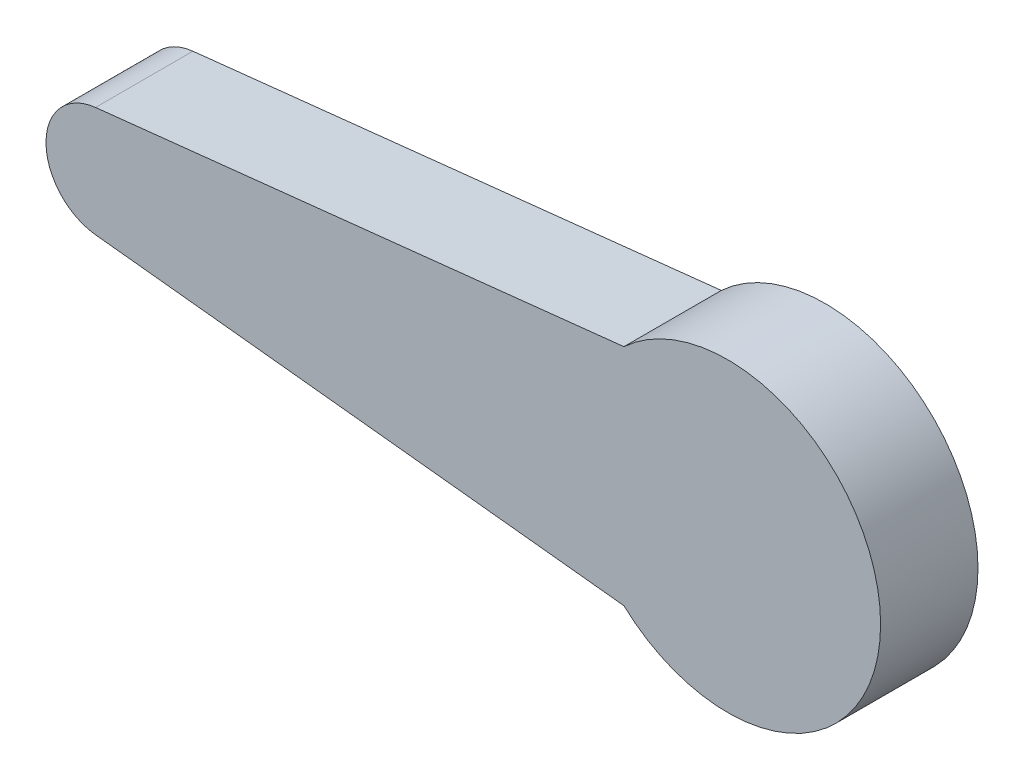
ISO-10303-21;
HEADER;
FILE_DESCRIPTION(('STEP AP214'),'2;1');
FILE_NAME('part.step','',(''),(''),'','','');
FILE_SCHEMA(('AUTOMOTIVE_DESIGN { 1 0 10303 214 1 1 1 1 }'));
ENDSEC;
DATA;
#1=APPLICATION_CONTEXT('core data for automotive mechanical design processes');
#2=APPLICATION_PROTOCOL_DEFINITION('international standard','automotive_design',2000,#1);
#3=PRODUCT_CONTEXT('',#1,'mechanical');
#4=PRODUCT('Part','Part','',(#3));
#5=PRODUCT_RELATED_PRODUCT_CATEGORY('part','',(#4));
#6=PRODUCT_DEFINITION_FORMATION('','',#4);
#7=PRODUCT_DEFINITION_CONTEXT('part definition',#1,'design');
#8=PRODUCT_DEFINITION('design','',#6,#7);
#9=PRODUCT_DEFINITION_SHAPE('','',#8);
#10=(LENGTH_UNIT() NAMED_UNIT(*) SI_UNIT(.MILLI.,.METRE.));
#11=(NAMED_UNIT(*) PLANE_ANGLE_UNIT() SI_UNIT($,.RADIAN.));
#12=(NAMED_UNIT(*) SI_UNIT($,.STERADIAN.) SOLID_ANGLE_UNIT());
#13=UNCERTAINTY_MEASURE_WITH_UNIT(LENGTH_MEASURE(1.E-05),#10,'distance_accuracy_value','');
#14=(GEOMETRIC_REPRESENTATION_CONTEXT(3) GLOBAL_UNCERTAINTY_ASSIGNED_CONTEXT((#13)) GLOBAL_UNIT_ASSIGNED_CONTEXT((#10,
#11,#12)) REPRESENTATION_CONTEXT('',''));
#15=CARTESIAN_POINT('',(0.,0.,0.));
#16=DIRECTION('',(0.,0.,1.));
#17=DIRECTION('',(1.,0.,0.));
#18=AXIS2_PLACEMENT_3D('',#15,#16,#17);
#19=CARTESIAN_POINT('',(-13.5203480100039,0.,0.));
#20=DIRECTION('',(0.,0.,1.));
#21=DIRECTION('',(1.,0.,0.));
#22=AXIS2_PLACEMENT_3D('',#19,#20,#21);
#23=PLANE('',#22);
#24=DIRECTION('',(-0.994225438983225,-0.10731158594771,0.));
#25=VECTOR('',#24,1.);
#26=CARTESIAN_POINT('',(7.93694518506527,4.60750982165337,0.));
#27=LINE('',#26,#25);
#28=CARTESIAN_POINT('',(7.93694518506527,4.60750982165337,0.));
#29=VERTEX_POINT('',#28);
#30=CARTESIAN_POINT('',(-13.7648346347147,2.26513120304724,0.));
#31=VERTEX_POINT('',#30);
#32=EDGE_CURVE('E133',#29,#31,#27,.T.);
#33=ORIENTED_EDGE('',*,*,#32,.F.);
#34=CARTESIAN_POINT('',(12.2013646778512,0.,0.));
#35=DIRECTION('',(0.,0.,-1.));
#36=DIRECTION('',(-1.,0.,0.));
#37=AXIS2_PLACEMENT_3D('',#34,#35,#36);
#38=CIRCLE('',#37,6.2780905032569);
#39=CARTESIAN_POINT('',(7.93694518506527,-4.60750982165337,0.));
#40=VERTEX_POINT('',#39);
#41=EDGE_CURVE('E144',#29,#40,#38,.T.);
#42=ORIENTED_EDGE('',*,*,#41,.T.);
#43=DIRECTION('',(0.994225438983225,-0.10731158594771,0.));
#44=VECTOR('',#43,1.);
#45=CARTESIAN_POINT('',(-13.7648346347147,-2.26513120304724,0.));
#46=LINE('',#45,#44);
#47=CARTESIAN_POINT('',(-13.7648346347147,-2.26513120304724,0.));
#48=VERTEX_POINT('',#47);
#49=EDGE_CURVE('E151',#48,#40,#46,.T.);
#50=ORIENTED_EDGE('',*,*,#49,.F.);
#51=CARTESIAN_POINT('',(-13.5203480100039,0.,0.));
#52=DIRECTION('',(0.,0.,1.));
#53=DIRECTION('',(1.,0.,0.));
#54=AXIS2_PLACEMENT_3D('',#51,#52,#53);
#55=CIRCLE('',#54,2.27828731214496);
#56=EDGE_CURVE('E136',#31,#48,#55,.T.);
#57=ORIENTED_EDGE('',*,*,#56,.F.);
#58=EDGE_LOOP('',(#33,#42,#50,#57));
#59=FACE_BOUND('',#58,.T.);
#60=CARTESIAN_POINT('',(-2.30825995095074,2.49806605279446,0.));
#61=CARTESIAN_POINT('',(-2.73027096534099,2.49868152297986,0.));
#62=CARTESIAN_POINT('',(-3.36525519111259,2.31776714159565,0.));
#63=CARTESIAN_POINT('',(-4.0519471173828,1.79121945249872,0.));
#64=CARTESIAN_POINT('',(-4.45450445000801,1.26652861552728,0.));
#65=CARTESIAN_POINT('',(-4.70755649296628,0.655614107295277,0.));
#66=CARTESIAN_POINT('',(-4.79387213088173,0.,0.));
#67=CARTESIAN_POINT('',(-4.70755649296628,-0.655614107295276,0.));
#68=CARTESIAN_POINT('',(-4.45450445000801,-1.26652861552729,0.));
#69=CARTESIAN_POINT('',(-4.0519471173828,-1.79121945249872,0.));
#70=CARTESIAN_POINT('',(-3.36525519111259,-2.31776714159565,0.));
#71=CARTESIAN_POINT('',(-2.73027096534099,-2.49868152297986,0.));
#72=CARTESIAN_POINT('',(-2.30825995095074,-2.49806605279446,0.));
#73=B_SPLINE_CURVE_WITH_KNOTS('',3,(#60,#61,#62,#63,#64,#65,#66,#67,#68,#69,#70,#71,#72),
.UNSPECIFIED.,.F.,.F.,(4,1,1,1,1,1,1,1,1,1,4),(0.,0.162547315698738,0.246910500112196,
0.331273484688599,0.415637005846892,0.5,0.584362994153108,0.668726515311401,0.753089499887804,
0.837452684301262,1.),.UNSPECIFIED.);
#74=CARTESIAN_POINT('',(-2.30825995095074,2.49806605279446,0.));
#75=VERTEX_POINT('',#74);
#76=CARTESIAN_POINT('',(-2.30825995095074,-2.49806605279446,0.));
#77=VERTEX_POINT('',#76);
#78=EDGE_CURVE('E55',#75,#77,#73,.T.);
#79=ORIENTED_EDGE('',*,*,#78,.T.);
#80=DIRECTION('',(0.998250566900798,-0.0591253387494285,0.));
#81=VECTOR('',#80,1.);
#82=CARTESIAN_POINT('',(9.37504414469004,-3.19005595520139,0.));
#83=LINE('',#82,#81);
#84=CARTESIAN_POINT('',(9.37504414469004,-3.19005595520139,0.));
#85=VERTEX_POINT('',#84);
#86=EDGE_CURVE('E132',#77,#85,#83,.T.);
#87=ORIENTED_EDGE('',*,*,#86,.T.);
#88=CARTESIAN_POINT('',(9.37504414469004,-3.19005595520139,0.));
#89=CARTESIAN_POINT('',(9.74360040876109,-3.53484293919703,0.));
#90=CARTESIAN_POINT('',(10.5428570191187,-3.88633535555283,0.));
#91=CARTESIAN_POINT('',(11.7382013204245,-4.05165126945385,0.));
#92=CARTESIAN_POINT('',(12.7877855246039,-3.91194774983133,0.));
#93=CARTESIAN_POINT('',(13.7642990955492,-3.50777948619926,0.));
#94=CARTESIAN_POINT('',(14.6032502640424,-2.86396771618949,0.));
#95=CARTESIAN_POINT('',(15.2468503589831,-2.02521728614815,0.));
#96=CARTESIAN_POINT('',(15.6516651084562,-1.04811231295659,0.));
#97=CARTESIAN_POINT('',(15.7889928154445,-0.000691817754812136,0.));
#98=CARTESIAN_POINT('',(15.6535287568039,1.05087958765089,0.));
#99=CARTESIAN_POINT('',(15.2393957517555,2.01553180953456,0.));
#100=CARTESIAN_POINT('',(14.749448402042,2.72799658708562,0.));
#101=CARTESIAN_POINT('',(14.1725249859326,3.12361030474993,0.));
#102=CARTESIAN_POINT('',(13.6476475877295,3.58835164958077,0.));
#103=CARTESIAN_POINT('',(12.7816062725977,3.90400354803467,0.));
#104=CARTESIAN_POINT('',(11.739855888239,4.05377842345117,0.));
#105=CARTESIAN_POINT('',(10.54211336446,3.88537929441961,0.));
#106=CARTESIAN_POINT('',(9.74376271711854,3.53505160690367,0.));
#107=CARTESIAN_POINT('',(9.37504414469004,3.19005595520139,0.));
#108=B_SPLINE_CURVE_WITH_KNOTS('',3,(#88,#89,#90,#91,#92,#93,#94,#95,#96,#97,#98,#99,#100,#101,
#102,#103,#104,#105,#106,#107),.UNSPECIFIED.,.F.,.F.,(4,1,1,1,1,1,1,1,1,1,1,1,1,1,1,1,1,4),(0.,
0.0851368769983083,0.144403022869954,0.2036691687416,0.262935433986645,0.32220149870547,
0.381467600441595,0.440733878928586,0.499999999999802,0.559266121071018,0.618532399558009,
0.677798501294134,0.702497282971547,0.737064566013355,0.7963308312584,0.855596977130046,
0.914863123001692,1.),.UNSPECIFIED.);
#109=CARTESIAN_POINT('',(9.37504414469004,3.19005595520139,0.));
#110=VERTEX_POINT('',#109);
#111=EDGE_CURVE('E304',#85,#110,#108,.T.);
#112=ORIENTED_EDGE('',*,*,#111,.T.);
#113=DIRECTION('',(-0.998250566900798,-0.0591253387494285,0.));
#114=VECTOR('',#113,1.);
#115=CARTESIAN_POINT('',(-2.30825995095074,2.49806605279446,0.));
#116=LINE('',#115,#114);
#117=EDGE_CURVE('E128',#110,#75,#116,.T.);
#118=ORIENTED_EDGE('',*,*,#117,.T.);
#119=EDGE_LOOP('',(#79,#87,#112,#118));
#120=FACE_BOUND('',#119,.T.);
#121=ADVANCED_FACE('F40',(#59,#120),#23,.F.);
#122=CARTESIAN_POINT('',(7.93694518506527,4.60750982165337,4.));
#123=DIRECTION('',(0.10731158594771,-0.994225438983225,0.));
#124=DIRECTION('',(0.994225438983225,0.10731158594771,0.));
#125=AXIS2_PLACEMENT_3D('',#122,#123,#124);
#126=PLANE('',#125);
#127=ORIENTED_EDGE('',*,*,#32,.T.);
#128=DIRECTION('',(0.,0.,-1.));
#129=VECTOR('',#128,1.);
#130=CARTESIAN_POINT('',(-13.7648346347147,2.26513120304724,4.));
#131=LINE('',#130,#129);
#132=CARTESIAN_POINT('',(-13.7648346347147,2.26513120304724,4.));
#133=VERTEX_POINT('',#132);
#134=EDGE_CURVE('E11',#133,#31,#131,.T.);
#135=ORIENTED_EDGE('',*,*,#134,.F.);
#136=DIRECTION('',(-0.994225438983225,-0.10731158594771,0.));
#137=VECTOR('',#136,1.);
#138=CARTESIAN_POINT('',(7.93694518506527,4.60750982165337,4.));
#139=LINE('',#138,#137);
#140=CARTESIAN_POINT('',(7.93694518506527,4.60750982165337,4.));
#141=VERTEX_POINT('',#140);
#142=EDGE_CURVE('E142',#141,#133,#139,.T.);
#143=ORIENTED_EDGE('',*,*,#142,.F.);
#144=DIRECTION('',(0.,0.,-1.));
#145=VECTOR('',#144,1.);
#146=CARTESIAN_POINT('',(7.93694518506527,4.60750982165337,4.));
#147=LINE('',#146,#145);
#148=EDGE_CURVE('E64',#141,#29,#147,.T.);
#149=ORIENTED_EDGE('',*,*,#148,.T.);
#150=EDGE_LOOP('',(#127,#135,#143,#149));
#151=FACE_BOUND('',#150,.T.);
#152=ADVANCED_FACE('F42',(#151),#126,.F.);
#153=CARTESIAN_POINT('',(-13.5203480100039,0.,4.));
#154=DIRECTION('',(0.,0.,-1.));
#155=DIRECTION('',(-1.,0.,0.));
#156=AXIS2_PLACEMENT_3D('',#153,#154,#155);
#157=CYLINDRICAL_SURFACE('',#156,2.27828731214496);
#158=ORIENTED_EDGE('',*,*,#56,.T.);
#159=DIRECTION('',(0.,0.,-1.));
#160=VECTOR('',#159,1.);
#161=CARTESIAN_POINT('',(-13.7648346347147,-2.26513120304724,4.));
#162=LINE('',#161,#160);
#163=CARTESIAN_POINT('',(-13.7648346347147,-2.26513120304724,4.));
#164=VERTEX_POINT('',#163);
#165=EDGE_CURVE('E48',#164,#48,#162,.T.);
#166=ORIENTED_EDGE('',*,*,#165,.F.);
#167=CARTESIAN_POINT('',(-13.5203480100039,0.,4.));
#168=DIRECTION('',(0.,0.,1.));
#169=DIRECTION('',(1.,0.,0.));
#170=AXIS2_PLACEMENT_3D('',#167,#168,#169);
#171=CIRCLE('',#170,2.27828731214496);
#172=EDGE_CURVE('E90',#133,#164,#171,.T.);
#173=ORIENTED_EDGE('',*,*,#172,.F.);
#174=ORIENTED_EDGE('',*,*,#134,.T.);
#175=EDGE_LOOP('',(#158,#166,#173,#174));
#176=FACE_BOUND('',#175,.T.);
#177=ADVANCED_FACE('F171',(#176),#157,.T.);
#178=CARTESIAN_POINT('',(-13.7648346347147,-2.26513120304724,4.));
#179=DIRECTION('',(0.10731158594771,0.994225438983225,0.));
#180=DIRECTION('',(-0.994225438983225,0.10731158594771,0.));
#181=AXIS2_PLACEMENT_3D('',#178,#179,#180);
#182=PLANE('',#181);
#183=ORIENTED_EDGE('',*,*,#49,.T.);
#184=DIRECTION('',(0.,0.,-1.));
#185=VECTOR('',#184,1.);
#186=CARTESIAN_POINT('',(7.93694518506527,-4.60750982165337,4.));
#187=LINE('',#186,#185);
#188=CARTESIAN_POINT('',(7.93694518506527,-4.60750982165337,4.));
#189=VERTEX_POINT('',#188);
#190=EDGE_CURVE('E157',#189,#40,#187,.T.);
#191=ORIENTED_EDGE('',*,*,#190,.F.);
#192=DIRECTION('',(0.994225438983225,-0.10731158594771,0.));
#193=VECTOR('',#192,1.);
#194=CARTESIAN_POINT('',(-13.7648346347147,-2.26513120304724,4.));
#195=LINE('',#194,#193);
#196=EDGE_CURVE('E146',#164,#189,#195,.T.);
#197=ORIENTED_EDGE('',*,*,#196,.F.);
#198=ORIENTED_EDGE('',*,*,#165,.T.);
#199=EDGE_LOOP('',(#183,#191,#197,#198));
#200=FACE_BOUND('',#199,.T.);
#201=ADVANCED_FACE('F162',(#200),#182,.F.);
#202=CARTESIAN_POINT('',(12.2013646778512,0.,4.));
#203=DIRECTION('',(0.,0.,-1.));
#204=DIRECTION('',(-1.,0.,0.));
#205=AXIS2_PLACEMENT_3D('',#202,#203,#204);
#206=CYLINDRICAL_SURFACE('',#205,6.2780905032569);
#207=ORIENTED_EDGE('',*,*,#41,.F.);
#208=ORIENTED_EDGE('',*,*,#148,.F.);
#209=CARTESIAN_POINT('',(12.2013646778512,0.,4.));
#210=DIRECTION('',(0.,0.,-1.));
#211=DIRECTION('',(-1.,0.,0.));
#212=AXIS2_PLACEMENT_3D('',#209,#210,#211);
#213=CIRCLE('',#212,6.2780905032569);
#214=EDGE_CURVE('E148',#141,#189,#213,.T.);
#215=ORIENTED_EDGE('',*,*,#214,.T.);
#216=ORIENTED_EDGE('',*,*,#190,.T.);
#217=EDGE_LOOP('',(#207,#208,#215,#216));
#218=FACE_BOUND('',#217,.T.);
#219=ADVANCED_FACE('F166',(#218),#206,.T.);
#220=CARTESIAN_POINT('',(-13.5203480100039,0.,4.));
#221=DIRECTION('',(0.,0.,1.));
#222=DIRECTION('',(1.,0.,0.));
#223=AXIS2_PLACEMENT_3D('',#220,#221,#222);
#224=PLANE('',#223);
#225=ORIENTED_EDGE('',*,*,#142,.T.);
#226=ORIENTED_EDGE('',*,*,#172,.T.);
#227=ORIENTED_EDGE('',*,*,#196,.T.);
#228=ORIENTED_EDGE('',*,*,#214,.F.);
#229=EDGE_LOOP('',(#225,#226,#227,#228));
#230=FACE_BOUND('',#229,.T.);
#231=ADVANCED_FACE('F169',(#230),#224,.T.);
#232=CARTESIAN_POINT('',(-2.30825995095074,2.49806605279446,2.));
#233=CARTESIAN_POINT('',(-2.73027096534099,2.49868152297986,2.));
#234=CARTESIAN_POINT('',(-3.36525519111259,2.31776714159565,2.));
#235=CARTESIAN_POINT('',(-4.0519471173828,1.79121945249872,2.));
#236=CARTESIAN_POINT('',(-4.45450445000801,1.26652861552728,2.));
#237=CARTESIAN_POINT('',(-4.70755649296628,0.655614107295277,2.));
#238=CARTESIAN_POINT('',(-4.79387213088173,0.,2.));
#239=CARTESIAN_POINT('',(-4.70755649296628,-0.655614107295276,2.));
#240=CARTESIAN_POINT('',(-4.45450445000801,-1.26652861552729,2.));
#241=CARTESIAN_POINT('',(-4.0519471173828,-1.79121945249872,2.));
#242=CARTESIAN_POINT('',(-3.36525519111259,-2.31776714159565,2.));
#243=CARTESIAN_POINT('',(-2.73027096534099,-2.49868152297986,2.));
#244=CARTESIAN_POINT('',(-2.30825995095074,-2.49806605279446,2.));
#245=B_SPLINE_CURVE_WITH_KNOTS('',3,(#232,#233,#234,#235,#236,#237,#238,#239,#240,#241,#242,
#243,#244),.UNSPECIFIED.,.F.,.F.,(4,1,1,1,1,1,1,1,1,1,4),(0.,0.162547315698738,
0.246910500112196,0.331273484688599,0.415637005846892,0.5,0.584362994153108,0.668726515311401,
0.753089499887804,0.837452684301262,1.),.UNSPECIFIED.);
#246=DIRECTION('',(0.,0.,-1.));
#247=VECTOR('',#246,1.);
#248=SURFACE_OF_LINEAR_EXTRUSION('',#245,#247);
#249=ORIENTED_EDGE('',*,*,#78,.F.);
#250=DIRECTION('',(0.,0.,-1.));
#251=VECTOR('',#250,1.);
#252=CARTESIAN_POINT('',(-2.30825995095074,2.49806605279446,2.));
#253=LINE('',#252,#251);
#254=CARTESIAN_POINT('',(-2.30825995095074,2.49806605279446,2.));
#255=VERTEX_POINT('',#254);
#256=EDGE_CURVE('E127',#255,#75,#253,.T.);
#257=ORIENTED_EDGE('',*,*,#256,.F.);
#258=CARTESIAN_POINT('',(-2.30825995095074,-2.49806605279446,2.));
#259=VERTEX_POINT('',#258);
#260=EDGE_CURVE('E119',#255,#259,#245,.T.);
#261=ORIENTED_EDGE('',*,*,#260,.T.);
#262=DIRECTION('',(0.,0.,-1.));
#263=VECTOR('',#262,1.);
#264=CARTESIAN_POINT('',(-2.30825995095074,-2.49806605279446,2.));
#265=LINE('',#264,#263);
#266=EDGE_CURVE('E126',#259,#77,#265,.T.);
#267=ORIENTED_EDGE('',*,*,#266,.T.);
#268=EDGE_LOOP('',(#249,#257,#261,#267));
#269=FACE_BOUND('',#268,.T.);
#270=ADVANCED_FACE('F125',(#269),#248,.T.);
#271=CARTESIAN_POINT('',(9.37504414469004,-3.19005595520139,2.));
#272=DIRECTION('',(0.0591253387494286,0.998250566900798,0.));
#273=DIRECTION('',(-0.998250566900798,0.0591253387494286,0.));
#274=AXIS2_PLACEMENT_3D('',#271,#272,#273);
#275=PLANE('',#274);
#276=ORIENTED_EDGE('',*,*,#86,.F.);
#277=ORIENTED_EDGE('',*,*,#266,.F.);
#278=DIRECTION('',(0.998250566900798,-0.0591253387494285,0.));
#279=VECTOR('',#278,1.);
#280=CARTESIAN_POINT('',(9.37504414469004,-3.19005595520139,2.));
#281=LINE('',#280,#279);
#282=CARTESIAN_POINT('',(9.37504414469004,-3.19005595520139,2.));
#283=VERTEX_POINT('',#282);
#284=EDGE_CURVE('E115',#259,#283,#281,.T.);
#285=ORIENTED_EDGE('',*,*,#284,.T.);
#286=DIRECTION('',(0.,0.,-1.));
#287=VECTOR('',#286,1.);
#288=CARTESIAN_POINT('',(9.37504414469004,-3.19005595520139,2.));
#289=LINE('',#288,#287);
#290=EDGE_CURVE('E134',#283,#85,#289,.T.);
#291=ORIENTED_EDGE('',*,*,#290,.T.);
#292=EDGE_LOOP('',(#276,#277,#285,#291));
#293=FACE_BOUND('',#292,.T.);
#294=ADVANCED_FACE('F130',(#293),#275,.T.);
#295=CARTESIAN_POINT('',(9.37504414469004,-3.19005595520139,2.));
#296=CARTESIAN_POINT('',(9.74360040876109,-3.53484293919703,2.));
#297=CARTESIAN_POINT('',(10.5428570191187,-3.88633535555283,2.));
#298=CARTESIAN_POINT('',(11.7382013204245,-4.05165126945385,2.));
#299=CARTESIAN_POINT('',(12.7877855246039,-3.91194774983133,2.));
#300=CARTESIAN_POINT('',(13.7642990955492,-3.50777948619926,2.));
#301=CARTESIAN_POINT('',(14.6032502640424,-2.86396771618949,2.));
#302=CARTESIAN_POINT('',(15.2468503589831,-2.02521728614815,2.));
#303=CARTESIAN_POINT('',(15.6516651084562,-1.04811231295659,2.));
#304=CARTESIAN_POINT('',(15.7889928154445,-0.000691817754812136,2.));
#305=CARTESIAN_POINT('',(15.6535287568039,1.05087958765089,2.));
#306=CARTESIAN_POINT('',(15.2393957517555,2.01553180953456,2.));
#307=CARTESIAN_POINT('',(14.749448402042,2.72799658708562,2.));
#308=CARTESIAN_POINT('',(14.1725249859326,3.12361030474993,2.));
#309=CARTESIAN_POINT('',(13.6476475877295,3.58835164958077,2.));
#310=CARTESIAN_POINT('',(12.7816062725977,3.90400354803467,2.));
#311=CARTESIAN_POINT('',(11.739855888239,4.05377842345117,2.));
#312=CARTESIAN_POINT('',(10.54211336446,3.88537929441961,2.));
#313=CARTESIAN_POINT('',(9.74376271711854,3.53505160690367,2.));
#314=CARTESIAN_POINT('',(9.37504414469004,3.19005595520139,2.));
#315=B_SPLINE_CURVE_WITH_KNOTS('',3,(#295,#296,#297,#298,#299,#300,#301,#302,#303,#304,#305,
#306,#307,#308,#309,#310,#311,#312,#313,#314),.UNSPECIFIED.,.F.,.F.,(4,1,1,1,1,1,1,1,1,1,1,1,1,
1,1,1,1,4),(0.,0.0851368769983083,0.144403022869954,0.2036691687416,0.262935433986645,
0.32220149870547,0.381467600441595,0.440733878928586,0.499999999999802,0.559266121071018,
0.618532399558009,0.677798501294134,0.702497282971547,0.737064566013355,0.7963308312584,
0.855596977130046,0.914863123001692,1.),.UNSPECIFIED.);
#316=DIRECTION('',(0.,0.,-1.));
#317=VECTOR('',#316,1.);
#318=SURFACE_OF_LINEAR_EXTRUSION('',#315,#317);
#319=ORIENTED_EDGE('',*,*,#111,.F.);
#320=ORIENTED_EDGE('',*,*,#290,.F.);
#321=CARTESIAN_POINT('',(9.37504414469004,3.19005595520139,2.));
#322=VERTEX_POINT('',#321);
#323=EDGE_CURVE('E120',#283,#322,#315,.T.);
#324=ORIENTED_EDGE('',*,*,#323,.T.);
#325=DIRECTION('',(0.,0.,-1.));
#326=VECTOR('',#325,1.);
#327=CARTESIAN_POINT('',(9.37504414469004,3.19005595520139,2.));
#328=LINE('',#327,#326);
#329=EDGE_CURVE('E138',#322,#110,#328,.T.);
#330=ORIENTED_EDGE('',*,*,#329,.T.);
#331=EDGE_LOOP('',(#319,#320,#324,#330));
#332=FACE_BOUND('',#331,.T.);
#333=ADVANCED_FACE('F195',(#332),#318,.T.);
#334=CARTESIAN_POINT('',(-2.30825995095074,2.49806605279446,2.));
#335=DIRECTION('',(0.0591253387494286,-0.998250566900798,0.));
#336=DIRECTION('',(0.998250566900798,0.0591253387494286,0.));
#337=AXIS2_PLACEMENT_3D('',#334,#335,#336);
#338=PLANE('',#337);
#339=ORIENTED_EDGE('',*,*,#117,.F.);
#340=ORIENTED_EDGE('',*,*,#329,.F.);
#341=DIRECTION('',(-0.998250566900798,-0.0591253387494285,0.));
#342=VECTOR('',#341,1.);
#343=CARTESIAN_POINT('',(-2.30825995095074,2.49806605279446,2.));
#344=LINE('',#343,#342);
#345=EDGE_CURVE('E209',#322,#255,#344,.T.);
#346=ORIENTED_EDGE('',*,*,#345,.T.);
#347=ORIENTED_EDGE('',*,*,#256,.T.);
#348=EDGE_LOOP('',(#339,#340,#346,#347));
#349=FACE_BOUND('',#348,.T.);
#350=ADVANCED_FACE('F216',(#349),#338,.T.);
#351=CARTESIAN_POINT('',(-4.76510031148791,0.,2.));
#352=DIRECTION('',(0.,0.,1.));
#353=DIRECTION('',(1.,0.,0.));
#354=AXIS2_PLACEMENT_3D('',#351,#352,#353);
#355=PLANE('',#354);
#356=ORIENTED_EDGE('',*,*,#260,.F.);
#357=ORIENTED_EDGE('',*,*,#345,.F.);
#358=ORIENTED_EDGE('',*,*,#323,.F.);
#359=ORIENTED_EDGE('',*,*,#284,.F.);
#360=EDGE_LOOP('',(#356,#357,#358,#359));
#361=FACE_BOUND('',#360,.T.);
#362=ADVANCED_FACE('F117',(#361),#355,.F.);
#363=CLOSED_SHELL('',(#121,#152,#177,#201,#219,#231,#270,#294,#333,#350,#362));
#364=MANIFOLD_SOLID_BREP('B2',#363);
#365=ADVANCED_BREP_SHAPE_REPRESENTATION('',(#18,#364),#14);
#366=SHAPE_DEFINITION_REPRESENTATION(#9,#365);
ENDSEC;
END-ISO-10303-21;
